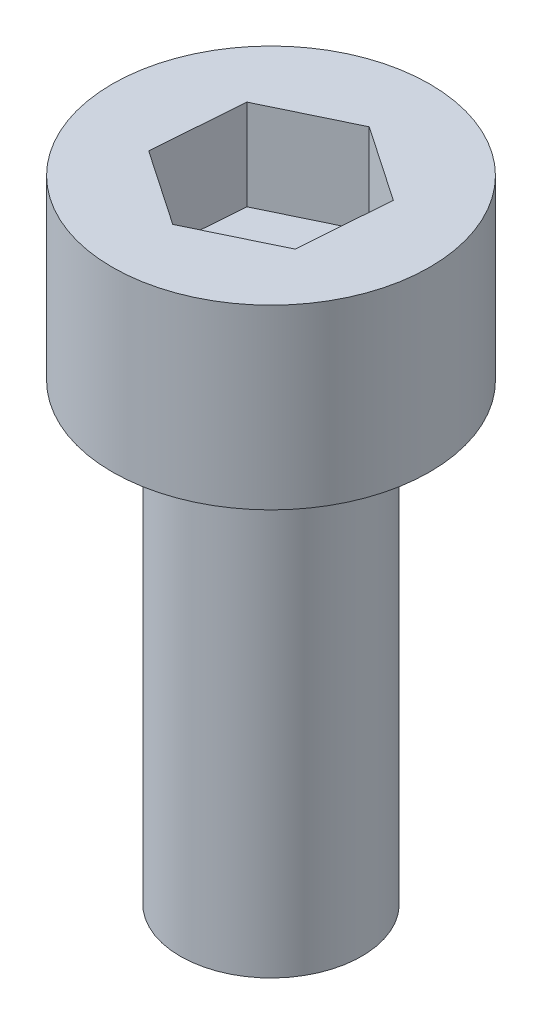
ISO-10303-21;
HEADER;
FILE_DESCRIPTION(('STEP AP214'),'2;1');
FILE_NAME('part.step','',(''),(''),'','','');
FILE_SCHEMA(('AUTOMOTIVE_DESIGN { 1 0 10303 214 1 1 1 1 }'));
ENDSEC;
DATA;
#1=APPLICATION_CONTEXT('core data for automotive mechanical design processes');
#2=APPLICATION_PROTOCOL_DEFINITION('international standard','automotive_design',2000,#1);
#3=PRODUCT_CONTEXT('',#1,'mechanical');
#4=PRODUCT('Part','Part','',(#3));
#5=PRODUCT_RELATED_PRODUCT_CATEGORY('part','',(#4));
#6=PRODUCT_DEFINITION_FORMATION('','',#4);
#7=PRODUCT_DEFINITION_CONTEXT('part definition',#1,'design');
#8=PRODUCT_DEFINITION('design','',#6,#7);
#9=PRODUCT_DEFINITION_SHAPE('','',#8);
#10=(LENGTH_UNIT() NAMED_UNIT(*) SI_UNIT(.MILLI.,.METRE.));
#11=(NAMED_UNIT(*) PLANE_ANGLE_UNIT() SI_UNIT($,.RADIAN.));
#12=(NAMED_UNIT(*) SI_UNIT($,.STERADIAN.) SOLID_ANGLE_UNIT());
#13=UNCERTAINTY_MEASURE_WITH_UNIT(LENGTH_MEASURE(1.E-05),#10,'distance_accuracy_value','');
#14=(GEOMETRIC_REPRESENTATION_CONTEXT(3) GLOBAL_UNCERTAINTY_ASSIGNED_CONTEXT((#13)) GLOBAL_UNIT_ASSIGNED_CONTEXT((#10,
#11,#12)) REPRESENTATION_CONTEXT('',''));
#15=CARTESIAN_POINT('',(0.,0.,0.));
#16=DIRECTION('',(0.,0.,1.));
#17=DIRECTION('',(1.,0.,0.));
#18=AXIS2_PLACEMENT_3D('',#15,#16,#17);
#19=CARTESIAN_POINT('',(0.,10.,0.));
#20=DIRECTION('',(0.,-1.,0.));
#21=DIRECTION('',(0.,0.,-1.));
#22=AXIS2_PLACEMENT_3D('',#19,#20,#21);
#23=CYLINDRICAL_SURFACE('',#22,2.);
#24=CARTESIAN_POINT('',(0.,10.,0.));
#25=DIRECTION('',(0.,1.,0.));
#26=DIRECTION('',(0.,0.,1.));
#27=AXIS2_PLACEMENT_3D('',#24,#25,#26);
#28=CIRCLE('',#27,2.);
#29=CARTESIAN_POINT('',(0.,10.,2.));
#30=VERTEX_POINT('',#29);
#31=EDGE_CURVE('E11',#30,#30,#28,.T.);
#32=ORIENTED_EDGE('',*,*,#31,.F.);
#33=EDGE_LOOP('',(#32));
#34=FACE_BOUND('',#33,.T.);
#35=CARTESIAN_POINT('',(0.,0.,0.));
#36=DIRECTION('',(0.,1.,0.));
#37=DIRECTION('',(0.,0.,1.));
#38=AXIS2_PLACEMENT_3D('',#35,#36,#37);
#39=CIRCLE('',#38,2.);
#40=CARTESIAN_POINT('',(0.,0.,2.));
#41=VERTEX_POINT('',#40);
#42=EDGE_CURVE('E42',#41,#41,#39,.T.);
#43=ORIENTED_EDGE('',*,*,#42,.T.);
#44=EDGE_LOOP('',(#43));
#45=FACE_BOUND('',#44,.T.);
#46=ADVANCED_FACE('F39',(#34,#45),#23,.T.);
#47=CARTESIAN_POINT('',(0.,0.,0.));
#48=DIRECTION('',(0.,1.,0.));
#49=DIRECTION('',(0.,0.,1.));
#50=AXIS2_PLACEMENT_3D('',#47,#48,#49);
#51=PLANE('',#50);
#52=ORIENTED_EDGE('',*,*,#42,.F.);
#53=EDGE_LOOP('',(#52));
#54=FACE_BOUND('',#53,.T.);
#55=ADVANCED_FACE('F189',(#54),#51,.F.);
#56=CARTESIAN_POINT('',(0.,13.91,0.));
#57=DIRECTION('',(0.,-1.,0.));
#58=DIRECTION('',(0.,0.,-1.));
#59=AXIS2_PLACEMENT_3D('',#56,#57,#58);
#60=CYLINDRICAL_SURFACE('',#59,3.5);
#61=CARTESIAN_POINT('',(0.,13.91,0.));
#62=DIRECTION('',(0.,1.,0.));
#63=DIRECTION('',(0.,0.,1.));
#64=AXIS2_PLACEMENT_3D('',#61,#62,#63);
#65=CIRCLE('',#64,3.5);
#66=CARTESIAN_POINT('',(0.,13.91,3.5));
#67=VERTEX_POINT('',#66);
#68=EDGE_CURVE('E163',#67,#67,#65,.T.);
#69=ORIENTED_EDGE('',*,*,#68,.F.);
#70=EDGE_LOOP('',(#69));
#71=FACE_BOUND('',#70,.T.);
#72=CARTESIAN_POINT('',(0.,10.,0.));
#73=DIRECTION('',(0.,1.,0.));
#74=DIRECTION('',(0.,0.,1.));
#75=AXIS2_PLACEMENT_3D('',#72,#73,#74);
#76=CIRCLE('',#75,3.5);
#77=CARTESIAN_POINT('',(0.,10.,3.5));
#78=VERTEX_POINT('',#77);
#79=EDGE_CURVE('E153',#78,#78,#76,.T.);
#80=ORIENTED_EDGE('',*,*,#79,.T.);
#81=EDGE_LOOP('',(#80));
#82=FACE_BOUND('',#81,.T.);
#83=ADVANCED_FACE('F171',(#71,#82),#60,.T.);
#84=CARTESIAN_POINT('',(0.,13.91,0.));
#85=DIRECTION('',(0.,1.,0.));
#86=DIRECTION('',(0.,0.,1.));
#87=AXIS2_PLACEMENT_3D('',#84,#85,#86);
#88=PLANE('',#87);
#89=DIRECTION('',(0.901055467383614,0.,-0.433703867515725));
#90=VECTOR('',#89,1.);
#91=CARTESIAN_POINT('',(-0.15141131098273,13.91,2.0150453960742));
#92=LINE('',#91,#90);
#93=CARTESIAN_POINT('',(-0.15141131098273,13.91,2.0150453960742));
#94=VERTEX_POINT('',#93);
#95=CARTESIAN_POINT('',(1.66937484728777,13.91,1.13864873976845));
#96=VERTEX_POINT('',#95);
#97=EDGE_CURVE('E54',#94,#96,#92,.T.);
#98=ORIENTED_EDGE('',*,*,#97,.F.);
#99=DIRECTION('',(0.826126300679985,0.,0.563484991215208));
#100=VECTOR('',#99,1.);
#101=CARTESIAN_POINT('',(-1.8207861582705,13.91,0.876396656305749));
#102=LINE('',#101,#100);
#103=CARTESIAN_POINT('',(-1.8207861582705,13.91,0.876396656305749));
#104=VERTEX_POINT('',#103);
#105=EDGE_CURVE('E147',#104,#94,#102,.T.);
#106=ORIENTED_EDGE('',*,*,#105,.F.);
#107=DIRECTION('',(-0.0749291667036284,0.,0.997188858730933));
#108=VECTOR('',#107,1.);
#109=CARTESIAN_POINT('',(-1.66937484728777,13.91,-1.13864873976845));
#110=LINE('',#109,#108);
#111=CARTESIAN_POINT('',(-1.66937484728777,13.91,-1.13864873976845));
#112=VERTEX_POINT('',#111);
#113=EDGE_CURVE('E144',#112,#104,#110,.T.);
#114=ORIENTED_EDGE('',*,*,#113,.F.);
#115=DIRECTION('',(-0.901055467383614,0.,0.433703867515725));
#116=VECTOR('',#115,1.);
#117=CARTESIAN_POINT('',(0.15141131098273,13.91,-2.0150453960742));
#118=LINE('',#117,#116);
#119=CARTESIAN_POINT('',(0.15141131098273,13.91,-2.0150453960742));
#120=VERTEX_POINT('',#119);
#121=EDGE_CURVE('E102',#120,#112,#118,.T.);
#122=ORIENTED_EDGE('',*,*,#121,.F.);
#123=DIRECTION('',(-0.826126300679985,0.,-0.563484991215208));
#124=VECTOR('',#123,1.);
#125=CARTESIAN_POINT('',(1.8207861582705,13.91,-0.87639665630575));
#126=LINE('',#125,#124);
#127=CARTESIAN_POINT('',(1.8207861582705,13.91,-0.87639665630575));
#128=VERTEX_POINT('',#127);
#129=EDGE_CURVE('E138',#128,#120,#126,.T.);
#130=ORIENTED_EDGE('',*,*,#129,.F.);
#131=DIRECTION('',(0.0749291667036284,0.,-0.997188858730933));
#132=VECTOR('',#131,1.);
#133=CARTESIAN_POINT('',(1.66937484728777,13.91,1.13864873976845));
#134=LINE('',#133,#132);
#135=EDGE_CURVE('E134',#96,#128,#134,.T.);
#136=ORIENTED_EDGE('',*,*,#135,.F.);
#137=EDGE_LOOP('',(#98,#106,#114,#122,#130,#136));
#138=FACE_BOUND('',#137,.T.);
#139=ORIENTED_EDGE('',*,*,#68,.T.);
#140=EDGE_LOOP('',(#139));
#141=FACE_BOUND('',#140,.T.);
#142=ADVANCED_FACE('F176',(#138,#141),#88,.T.);
#143=CARTESIAN_POINT('',(0.,10.,0.));
#144=DIRECTION('',(0.,1.,0.));
#145=DIRECTION('',(0.,0.,1.));
#146=AXIS2_PLACEMENT_3D('',#143,#144,#145);
#147=PLANE('',#146);
#148=ORIENTED_EDGE('',*,*,#31,.T.);
#149=EDGE_LOOP('',(#148));
#150=FACE_BOUND('',#149,.T.);
#151=ORIENTED_EDGE('',*,*,#79,.F.);
#152=EDGE_LOOP('',(#151));
#153=FACE_BOUND('',#152,.T.);
#154=ADVANCED_FACE('F173',(#150,#153),#147,.F.);
#155=CARTESIAN_POINT('',(-0.15141131098273,11.91,2.0150453960742));
#156=DIRECTION('',(0.433703867515725,0.,0.901055467383614));
#157=DIRECTION('',(0.901055467383614,0.,-0.433703867515725));
#158=AXIS2_PLACEMENT_3D('',#155,#156,#157);
#159=PLANE('',#158);
#160=ORIENTED_EDGE('',*,*,#97,.T.);
#161=DIRECTION('',(0.,1.,0.));
#162=VECTOR('',#161,1.);
#163=CARTESIAN_POINT('',(1.66937484728777,11.91,1.13864873976845));
#164=LINE('',#163,#162);
#165=CARTESIAN_POINT('',(1.66937484728777,11.91,1.13864873976845));
#166=VERTEX_POINT('',#165);
#167=EDGE_CURVE('E84',#166,#96,#164,.T.);
#168=ORIENTED_EDGE('',*,*,#167,.F.);
#169=DIRECTION('',(0.901055467383614,0.,-0.433703867515725));
#170=VECTOR('',#169,1.);
#171=CARTESIAN_POINT('',(-0.15141131098273,11.91,2.0150453960742));
#172=LINE('',#171,#170);
#173=CARTESIAN_POINT('',(-0.15141131098273,11.91,2.0150453960742));
#174=VERTEX_POINT('',#173);
#175=EDGE_CURVE('E150',#174,#166,#172,.T.);
#176=ORIENTED_EDGE('',*,*,#175,.F.);
#177=DIRECTION('',(0.,1.,0.));
#178=VECTOR('',#177,1.);
#179=CARTESIAN_POINT('',(-0.15141131098273,11.91,2.0150453960742));
#180=LINE('',#179,#178);
#181=EDGE_CURVE('E62',#174,#94,#180,.T.);
#182=ORIENTED_EDGE('',*,*,#181,.T.);
#183=EDGE_LOOP('',(#160,#168,#176,#182));
#184=FACE_BOUND('',#183,.T.);
#185=ADVANCED_FACE('F175',(#184),#159,.F.);
#186=CARTESIAN_POINT('',(-1.8207861582705,11.91,0.876396656305749));
#187=DIRECTION('',(-0.563484991215208,0.,0.826126300679985));
#188=DIRECTION('',(0.826126300679985,0.,0.563484991215208));
#189=AXIS2_PLACEMENT_3D('',#186,#187,#188);
#190=PLANE('',#189);
#191=ORIENTED_EDGE('',*,*,#105,.T.);
#192=ORIENTED_EDGE('',*,*,#181,.F.);
#193=DIRECTION('',(0.826126300679985,0.,0.563484991215208));
#194=VECTOR('',#193,1.);
#195=CARTESIAN_POINT('',(-1.8207861582705,11.91,0.876396656305749));
#196=LINE('',#195,#194);
#197=CARTESIAN_POINT('',(-1.8207861582705,11.91,0.876396656305749));
#198=VERTEX_POINT('',#197);
#199=EDGE_CURVE('E116',#198,#174,#196,.T.);
#200=ORIENTED_EDGE('',*,*,#199,.F.);
#201=DIRECTION('',(0.,1.,0.));
#202=VECTOR('',#201,1.);
#203=CARTESIAN_POINT('',(-1.8207861582705,11.91,0.876396656305749));
#204=LINE('',#203,#202);
#205=EDGE_CURVE('E107',#198,#104,#204,.T.);
#206=ORIENTED_EDGE('',*,*,#205,.T.);
#207=EDGE_LOOP('',(#191,#192,#200,#206));
#208=FACE_BOUND('',#207,.T.);
#209=ADVANCED_FACE('F183',(#208),#190,.F.);
#210=CARTESIAN_POINT('',(-1.66937484728777,11.91,-1.13864873976845));
#211=DIRECTION('',(-0.997188858730932,0.,-0.0749291667036284));
#212=DIRECTION('',(-0.0749291667036284,0.,0.997188858730933));
#213=AXIS2_PLACEMENT_3D('',#210,#211,#212);
#214=PLANE('',#213);
#215=ORIENTED_EDGE('',*,*,#113,.T.);
#216=ORIENTED_EDGE('',*,*,#205,.F.);
#217=DIRECTION('',(-0.0749291667036284,0.,0.997188858730933));
#218=VECTOR('',#217,1.);
#219=CARTESIAN_POINT('',(-1.66937484728777,11.91,-1.13864873976845));
#220=LINE('',#219,#218);
#221=CARTESIAN_POINT('',(-1.66937484728777,11.91,-1.13864873976845));
#222=VERTEX_POINT('',#221);
#223=EDGE_CURVE('E111',#222,#198,#220,.T.);
#224=ORIENTED_EDGE('',*,*,#223,.F.);
#225=DIRECTION('',(0.,1.,0.));
#226=VECTOR('',#225,1.);
#227=CARTESIAN_POINT('',(-1.66937484728777,11.91,-1.13864873976845));
#228=LINE('',#227,#226);
#229=EDGE_CURVE('E95',#222,#112,#228,.T.);
#230=ORIENTED_EDGE('',*,*,#229,.T.);
#231=EDGE_LOOP('',(#215,#216,#224,#230));
#232=FACE_BOUND('',#231,.T.);
#233=ADVANCED_FACE('F112',(#232),#214,.F.);
#234=CARTESIAN_POINT('',(0.15141131098273,11.91,-2.0150453960742));
#235=DIRECTION('',(-0.433703867515725,0.,-0.901055467383614));
#236=DIRECTION('',(-0.901055467383614,0.,0.433703867515725));
#237=AXIS2_PLACEMENT_3D('',#234,#235,#236);
#238=PLANE('',#237);
#239=ORIENTED_EDGE('',*,*,#121,.T.);
#240=ORIENTED_EDGE('',*,*,#229,.F.);
#241=DIRECTION('',(-0.901055467383614,0.,0.433703867515725));
#242=VECTOR('',#241,1.);
#243=CARTESIAN_POINT('',(0.15141131098273,11.91,-2.0150453960742));
#244=LINE('',#243,#242);
#245=CARTESIAN_POINT('',(0.15141131098273,11.91,-2.0150453960742));
#246=VERTEX_POINT('',#245);
#247=EDGE_CURVE('E99',#246,#222,#244,.T.);
#248=ORIENTED_EDGE('',*,*,#247,.F.);
#249=DIRECTION('',(0.,1.,0.));
#250=VECTOR('',#249,1.);
#251=CARTESIAN_POINT('',(0.15141131098273,11.91,-2.0150453960742));
#252=LINE('',#251,#250);
#253=EDGE_CURVE('E108',#246,#120,#252,.T.);
#254=ORIENTED_EDGE('',*,*,#253,.T.);
#255=EDGE_LOOP('',(#239,#240,#248,#254));
#256=FACE_BOUND('',#255,.T.);
#257=ADVANCED_FACE('F97',(#256),#238,.F.);
#258=CARTESIAN_POINT('',(1.8207861582705,11.91,-0.87639665630575));
#259=DIRECTION('',(0.563484991215208,0.,-0.826126300679985));
#260=DIRECTION('',(-0.826126300679985,0.,-0.563484991215208));
#261=AXIS2_PLACEMENT_3D('',#258,#259,#260);
#262=PLANE('',#261);
#263=ORIENTED_EDGE('',*,*,#129,.T.);
#264=ORIENTED_EDGE('',*,*,#253,.F.);
#265=DIRECTION('',(-0.826126300679985,0.,-0.563484991215208));
#266=VECTOR('',#265,1.);
#267=CARTESIAN_POINT('',(1.8207861582705,11.91,-0.87639665630575));
#268=LINE('',#267,#266);
#269=CARTESIAN_POINT('',(1.8207861582705,11.91,-0.87639665630575));
#270=VERTEX_POINT('',#269);
#271=EDGE_CURVE('E122',#270,#246,#268,.T.);
#272=ORIENTED_EDGE('',*,*,#271,.F.);
#273=DIRECTION('',(0.,1.,0.));
#274=VECTOR('',#273,1.);
#275=CARTESIAN_POINT('',(1.8207861582705,11.91,-0.87639665630575));
#276=LINE('',#275,#274);
#277=EDGE_CURVE('E158',#270,#128,#276,.T.);
#278=ORIENTED_EDGE('',*,*,#277,.T.);
#279=EDGE_LOOP('',(#263,#264,#272,#278));
#280=FACE_BOUND('',#279,.T.);
#281=ADVANCED_FACE('F245',(#280),#262,.F.);
#282=CARTESIAN_POINT('',(1.66937484728777,11.91,1.13864873976845));
#283=DIRECTION('',(0.997188858730932,0.,0.0749291667036284));
#284=DIRECTION('',(0.0749291667036284,0.,-0.997188858730933));
#285=AXIS2_PLACEMENT_3D('',#282,#283,#284);
#286=PLANE('',#285);
#287=ORIENTED_EDGE('',*,*,#135,.T.);
#288=ORIENTED_EDGE('',*,*,#277,.F.);
#289=DIRECTION('',(0.0749291667036284,0.,-0.997188858730933));
#290=VECTOR('',#289,1.);
#291=CARTESIAN_POINT('',(1.66937484728777,11.91,1.13864873976845));
#292=LINE('',#291,#290);
#293=EDGE_CURVE('E126',#166,#270,#292,.T.);
#294=ORIENTED_EDGE('',*,*,#293,.F.);
#295=ORIENTED_EDGE('',*,*,#167,.T.);
#296=EDGE_LOOP('',(#287,#288,#294,#295));
#297=FACE_BOUND('',#296,.T.);
#298=ADVANCED_FACE('F254',(#297),#286,.F.);
#299=CARTESIAN_POINT('',(0.,11.91,0.));
#300=DIRECTION('',(0.,1.,0.));
#301=DIRECTION('',(0.,0.,1.));
#302=AXIS2_PLACEMENT_3D('',#299,#300,#301);
#303=PLANE('',#302);
#304=ORIENTED_EDGE('',*,*,#175,.T.);
#305=ORIENTED_EDGE('',*,*,#293,.T.);
#306=ORIENTED_EDGE('',*,*,#271,.T.);
#307=ORIENTED_EDGE('',*,*,#247,.T.);
#308=ORIENTED_EDGE('',*,*,#223,.T.);
#309=ORIENTED_EDGE('',*,*,#199,.T.);
#310=EDGE_LOOP('',(#304,#305,#306,#307,#308,#309));
#311=FACE_BOUND('',#310,.T.);
#312=ADVANCED_FACE('F119',(#311),#303,.T.);
#313=CLOSED_SHELL('',(#46,#55,#83,#142,#154,#185,#209,#233,#257,#281,#298,#312));
#314=MANIFOLD_SOLID_BREP('B2',#313);
#315=ADVANCED_BREP_SHAPE_REPRESENTATION('',(#18,#314),#14);
#316=SHAPE_DEFINITION_REPRESENTATION(#9,#315);
ENDSEC;
END-ISO-10303-21;
